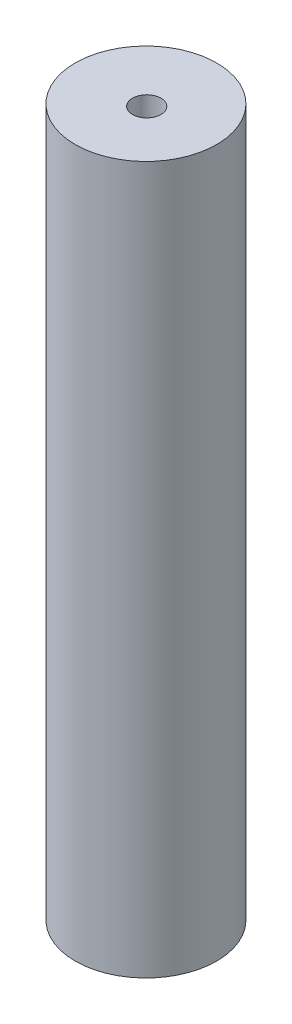
ISO-10303-21;
HEADER;
FILE_DESCRIPTION(('STEP AP214'),'2;1');
FILE_NAME('part.step','',(''),(''),'','','');
FILE_SCHEMA(('AUTOMOTIVE_DESIGN { 1 0 10303 214 1 1 1 1 }'));
ENDSEC;
DATA;
#1=APPLICATION_CONTEXT('core data for automotive mechanical design processes');
#2=APPLICATION_PROTOCOL_DEFINITION('international standard','automotive_design',2000,#1);
#3=PRODUCT_CONTEXT('',#1,'mechanical');
#4=PRODUCT('Part','Part','',(#3));
#5=PRODUCT_RELATED_PRODUCT_CATEGORY('part','',(#4));
#6=PRODUCT_DEFINITION_FORMATION('','',#4);
#7=PRODUCT_DEFINITION_CONTEXT('part definition',#1,'design');
#8=PRODUCT_DEFINITION('design','',#6,#7);
#9=PRODUCT_DEFINITION_SHAPE('','',#8);
#10=(LENGTH_UNIT() NAMED_UNIT(*) SI_UNIT(.MILLI.,.METRE.));
#11=(NAMED_UNIT(*) PLANE_ANGLE_UNIT() SI_UNIT($,.RADIAN.));
#12=(NAMED_UNIT(*) SI_UNIT($,.STERADIAN.) SOLID_ANGLE_UNIT());
#13=UNCERTAINTY_MEASURE_WITH_UNIT(LENGTH_MEASURE(1.E-05),#10,'distance_accuracy_value','');
#14=(GEOMETRIC_REPRESENTATION_CONTEXT(3) GLOBAL_UNCERTAINTY_ASSIGNED_CONTEXT((#13)) GLOBAL_UNIT_ASSIGNED_CONTEXT((#10,
#11,#12)) REPRESENTATION_CONTEXT('',''));
#15=CARTESIAN_POINT('',(0.,0.,0.));
#16=DIRECTION('',(0.,0.,1.));
#17=DIRECTION('',(1.,0.,0.));
#18=AXIS2_PLACEMENT_3D('',#15,#16,#17);
#19=CARTESIAN_POINT('',(0.,127.,0.));
#20=DIRECTION('',(0.,-1.,0.));
#21=DIRECTION('',(0.,0.,-1.));
#22=AXIS2_PLACEMENT_3D('',#19,#20,#21);
#23=CYLINDRICAL_SURFACE('',#22,12.7);
#24=CARTESIAN_POINT('',(0.,127.,0.));
#25=DIRECTION('',(0.,1.,0.));
#26=DIRECTION('',(0.,0.,1.));
#27=AXIS2_PLACEMENT_3D('',#24,#25,#26);
#28=CIRCLE('',#27,12.7);
#29=CARTESIAN_POINT('',(0.,127.,12.7));
#30=VERTEX_POINT('',#29);
#31=EDGE_CURVE('E11',#30,#30,#28,.T.);
#32=ORIENTED_EDGE('',*,*,#31,.F.);
#33=EDGE_LOOP('',(#32));
#34=FACE_BOUND('',#33,.T.);
#35=CARTESIAN_POINT('',(0.,0.,0.));
#36=DIRECTION('',(0.,1.,0.));
#37=DIRECTION('',(0.,0.,1.));
#38=AXIS2_PLACEMENT_3D('',#35,#36,#37);
#39=CIRCLE('',#38,12.7);
#40=CARTESIAN_POINT('',(0.,0.,12.7));
#41=VERTEX_POINT('',#40);
#42=EDGE_CURVE('E39',#41,#41,#39,.T.);
#43=ORIENTED_EDGE('',*,*,#42,.T.);
#44=EDGE_LOOP('',(#43));
#45=FACE_BOUND('',#44,.T.);
#46=ADVANCED_FACE('F36',(#34,#45),#23,.T.);
#47=CARTESIAN_POINT('',(0.,127.,0.));
#48=DIRECTION('',(0.,1.,0.));
#49=DIRECTION('',(0.,0.,1.));
#50=AXIS2_PLACEMENT_3D('',#47,#48,#49);
#51=PLANE('',#50);
#52=CARTESIAN_POINT('',(0.473892962771227,127.,0.332854466309485));
#53=DIRECTION('',(0.,1.,0.));
#54=DIRECTION('',(0.,0.,1.));
#55=AXIS2_PLACEMENT_3D('',#52,#53,#54);
#56=CIRCLE('',#55,2.55269999999999);
#57=CARTESIAN_POINT('',(0.473892962771227,127.,2.88555446630947));
#58=VERTEX_POINT('',#57);
#59=EDGE_CURVE('E59',#58,#58,#56,.T.);
#60=ORIENTED_EDGE('',*,*,#59,.F.);
#61=EDGE_LOOP('',(#60));
#62=FACE_BOUND('',#61,.T.);
#63=ORIENTED_EDGE('',*,*,#31,.T.);
#64=EDGE_LOOP('',(#63));
#65=FACE_BOUND('',#64,.T.);
#66=ADVANCED_FACE('F78',(#62,#65),#51,.T.);
#67=CARTESIAN_POINT('',(0.,0.,0.));
#68=DIRECTION('',(0.,1.,0.));
#69=DIRECTION('',(0.,0.,1.));
#70=AXIS2_PLACEMENT_3D('',#67,#68,#69);
#71=PLANE('',#70);
#72=CARTESIAN_POINT('',(0.473892962771227,0.,0.332854466309485));
#73=DIRECTION('',(0.,-1.,0.));
#74=DIRECTION('',(0.,0.,-1.));
#75=AXIS2_PLACEMENT_3D('',#72,#73,#74);
#76=CIRCLE('',#75,2.55269999999999);
#77=CARTESIAN_POINT('',(0.473892962771227,0.,-2.2198455336905));
#78=VERTEX_POINT('',#77);
#79=EDGE_CURVE('E60',#78,#78,#76,.T.);
#80=ORIENTED_EDGE('',*,*,#79,.F.);
#81=EDGE_LOOP('',(#80));
#82=FACE_BOUND('',#81,.T.);
#83=ORIENTED_EDGE('',*,*,#42,.F.);
#84=EDGE_LOOP('',(#83));
#85=FACE_BOUND('',#84,.T.);
#86=ADVANCED_FACE('F75',(#82,#85),#71,.F.);
#87=CARTESIAN_POINT('',(0.473892962771227,95.25,0.332854466309485));
#88=DIRECTION('',(0.,1.,0.));
#89=DIRECTION('',(0.,0.,1.));
#90=AXIS2_PLACEMENT_3D('',#87,#88,#89);
#91=CONICAL_SURFACE('',#90,2.55269999999999,1.02974425867665);
#92=CARTESIAN_POINT('',(0.473892962771219,93.7161830978084,0.332854466309485));
#93=VERTEX_POINT('',#92);
#94=VERTEX_LOOP('',#93);
#95=FACE_BOUND('',#94,.T.);
#96=CARTESIAN_POINT('',(0.473892962771227,95.25,0.332854466309485));
#97=DIRECTION('',(0.,1.,0.));
#98=DIRECTION('',(0.,0.,1.));
#99=AXIS2_PLACEMENT_3D('',#96,#97,#98);
#100=CIRCLE('',#99,2.55269999999999);
#101=CARTESIAN_POINT('',(0.473892962771227,95.25,2.88555446630947));
#102=VERTEX_POINT('',#101);
#103=EDGE_CURVE('E63',#102,#102,#100,.T.);
#104=ORIENTED_EDGE('',*,*,#103,.T.);
#105=EDGE_LOOP('',(#104));
#106=FACE_BOUND('',#105,.T.);
#107=ADVANCED_FACE('F77',(#95,#106),#91,.F.);
#108=CARTESIAN_POINT('',(0.473892962771227,127.,0.332854466309485));
#109=DIRECTION('',(0.,1.,0.));
#110=DIRECTION('',(0.,0.,1.));
#111=AXIS2_PLACEMENT_3D('',#108,#109,#110);
#112=CYLINDRICAL_SURFACE('',#111,2.55269999999999);
#113=ORIENTED_EDGE('',*,*,#103,.F.);
#114=EDGE_LOOP('',(#113));
#115=FACE_BOUND('',#114,.T.);
#116=ORIENTED_EDGE('',*,*,#59,.T.);
#117=EDGE_LOOP('',(#116));
#118=FACE_BOUND('',#117,.T.);
#119=ADVANCED_FACE('F53',(#115,#118),#112,.F.);
#120=CARTESIAN_POINT('',(0.473892962771227,31.75,0.332854466309485));
#121=DIRECTION('',(0.,-1.,0.));
#122=DIRECTION('',(0.,0.,-1.));
#123=AXIS2_PLACEMENT_3D('',#120,#121,#122);
#124=CONICAL_SURFACE('',#123,2.55269999999999,1.02974425867665);
#125=CARTESIAN_POINT('',(0.473892962771219,33.2838169021917,0.332854466309485));
#126=VERTEX_POINT('',#125);
#127=VERTEX_LOOP('',#126);
#128=FACE_BOUND('',#127,.T.);
#129=CARTESIAN_POINT('',(0.473892962771227,31.75,0.332854466309485));
#130=DIRECTION('',(0.,-1.,0.));
#131=DIRECTION('',(0.,0.,-1.));
#132=AXIS2_PLACEMENT_3D('',#129,#130,#131);
#133=CIRCLE('',#132,2.55269999999999);
#134=CARTESIAN_POINT('',(0.473892962771227,31.75,-2.2198455336905));
#135=VERTEX_POINT('',#134);
#136=EDGE_CURVE('E57',#135,#135,#133,.T.);
#137=ORIENTED_EDGE('',*,*,#136,.T.);
#138=EDGE_LOOP('',(#137));
#139=FACE_BOUND('',#138,.T.);
#140=ADVANCED_FACE('F49',(#128,#139),#124,.F.);
#141=CARTESIAN_POINT('',(0.473892962771227,0.,0.332854466309485));
#142=DIRECTION('',(0.,-1.,0.));
#143=DIRECTION('',(0.,0.,-1.));
#144=AXIS2_PLACEMENT_3D('',#141,#142,#143);
#145=CYLINDRICAL_SURFACE('',#144,2.55269999999999);
#146=ORIENTED_EDGE('',*,*,#136,.F.);
#147=EDGE_LOOP('',(#146));
#148=FACE_BOUND('',#147,.T.);
#149=ORIENTED_EDGE('',*,*,#79,.T.);
#150=EDGE_LOOP('',(#149));
#151=FACE_BOUND('',#150,.T.);
#152=ADVANCED_FACE('F52',(#148,#151),#145,.F.);
#153=CLOSED_SHELL('',(#46,#66,#86,#107,#119,#140,#152));
#154=MANIFOLD_SOLID_BREP('B2',#153);
#155=ADVANCED_BREP_SHAPE_REPRESENTATION('',(#18,#154),#14);
#156=SHAPE_DEFINITION_REPRESENTATION(#9,#155);
ENDSEC;
END-ISO-10303-21;
